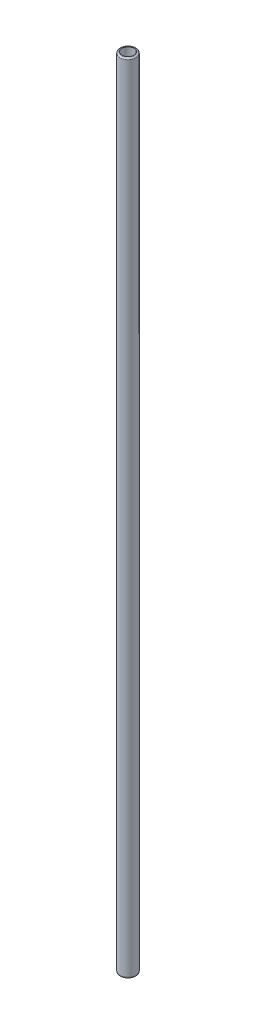
ISO-10303-21;
HEADER;
FILE_DESCRIPTION(('STEP AP214'),'2;1');
FILE_NAME('part.step','',(''),(''),'','','');
FILE_SCHEMA(('AUTOMOTIVE_DESIGN { 1 0 10303 214 1 1 1 1 }'));
ENDSEC;
DATA;
#1=APPLICATION_CONTEXT('core data for automotive mechanical design processes');
#2=APPLICATION_PROTOCOL_DEFINITION('international standard','automotive_design',2000,#1);
#3=PRODUCT_CONTEXT('',#1,'mechanical');
#4=PRODUCT('Part','Part','',(#3));
#5=PRODUCT_RELATED_PRODUCT_CATEGORY('part','',(#4));
#6=PRODUCT_DEFINITION_FORMATION('','',#4);
#7=PRODUCT_DEFINITION_CONTEXT('part definition',#1,'design');
#8=PRODUCT_DEFINITION('design','',#6,#7);
#9=PRODUCT_DEFINITION_SHAPE('','',#8);
#10=(LENGTH_UNIT() NAMED_UNIT(*) SI_UNIT(.MILLI.,.METRE.));
#11=(NAMED_UNIT(*) PLANE_ANGLE_UNIT() SI_UNIT($,.RADIAN.));
#12=(NAMED_UNIT(*) SI_UNIT($,.STERADIAN.) SOLID_ANGLE_UNIT());
#13=UNCERTAINTY_MEASURE_WITH_UNIT(LENGTH_MEASURE(1.E-05),#10,'distance_accuracy_value','');
#14=(GEOMETRIC_REPRESENTATION_CONTEXT(3) GLOBAL_UNCERTAINTY_ASSIGNED_CONTEXT((#13)) GLOBAL_UNIT_ASSIGNED_CONTEXT((#10,
#11,#12)) REPRESENTATION_CONTEXT('',''));
#15=CARTESIAN_POINT('',(0.,0.,0.));
#16=DIRECTION('',(0.,0.,1.));
#17=DIRECTION('',(1.,0.,0.));
#18=AXIS2_PLACEMENT_3D('',#15,#16,#17);
#19=CARTESIAN_POINT('',(0.,600.,0.));
#20=DIRECTION('',(0.,1.,0.));
#21=DIRECTION('',(0.,0.,1.));
#22=AXIS2_PLACEMENT_3D('',#19,#20,#21);
#23=PLANE('',#22);
#24=CARTESIAN_POINT('',(0.,600.,0.));
#25=DIRECTION('',(0.,1.,0.));
#26=DIRECTION('',(0.,0.,1.));
#27=AXIS2_PLACEMENT_3D('',#24,#25,#26);
#28=CIRCLE('',#27,5.);
#29=CARTESIAN_POINT('',(0.,600.,5.));
#30=VERTEX_POINT('',#29);
#31=EDGE_CURVE('E41',#30,#30,#28,.T.);
#32=ORIENTED_EDGE('',*,*,#31,.T.);
#33=EDGE_LOOP('',(#32));
#34=FACE_BOUND('',#33,.T.);
#35=CARTESIAN_POINT('',(0.,600.,0.));
#36=DIRECTION('',(0.,1.,0.));
#37=DIRECTION('',(0.,0.,1.));
#38=AXIS2_PLACEMENT_3D('',#35,#36,#37);
#39=CIRCLE('',#38,4.5);
#40=CARTESIAN_POINT('',(0.,600.,4.5));
#41=VERTEX_POINT('',#40);
#42=EDGE_CURVE('E54',#41,#41,#39,.T.);
#43=ORIENTED_EDGE('',*,*,#42,.F.);
#44=EDGE_LOOP('',(#43));
#45=FACE_BOUND('',#44,.T.);
#46=ADVANCED_FACE('F34',(#34,#45),#23,.T.);
#47=CARTESIAN_POINT('',(0.,0.,0.));
#48=DIRECTION('',(0.,1.,0.));
#49=DIRECTION('',(0.,0.,1.));
#50=AXIS2_PLACEMENT_3D('',#47,#48,#49);
#51=PLANE('',#50);
#52=CARTESIAN_POINT('',(0.,0.,0.));
#53=DIRECTION('',(0.,1.,0.));
#54=DIRECTION('',(0.,0.,1.));
#55=AXIS2_PLACEMENT_3D('',#52,#53,#54);
#56=CIRCLE('',#55,5.);
#57=CARTESIAN_POINT('',(0.,0.,5.));
#58=VERTEX_POINT('',#57);
#59=EDGE_CURVE('E45',#58,#58,#56,.F.);
#60=ORIENTED_EDGE('',*,*,#59,.T.);
#61=EDGE_LOOP('',(#60));
#62=FACE_BOUND('',#61,.T.);
#63=CARTESIAN_POINT('',(0.,0.,0.));
#64=DIRECTION('',(0.,1.,0.));
#65=DIRECTION('',(0.,0.,1.));
#66=AXIS2_PLACEMENT_3D('',#63,#64,#65);
#67=CIRCLE('',#66,4.5);
#68=CARTESIAN_POINT('',(0.,0.,4.5));
#69=VERTEX_POINT('',#68);
#70=EDGE_CURVE('E55',#69,#69,#67,.T.);
#71=ORIENTED_EDGE('',*,*,#70,.T.);
#72=EDGE_LOOP('',(#71));
#73=FACE_BOUND('',#72,.T.);
#74=ADVANCED_FACE('F65',(#62,#73),#51,.F.);
#75=CARTESIAN_POINT('',(0.,600.,0.));
#76=DIRECTION('',(0.,-1.,0.));
#77=DIRECTION('',(0.,0.,-1.));
#78=AXIS2_PLACEMENT_3D('',#75,#76,#77);
#79=CYLINDRICAL_SURFACE('',#78,6.);
#80=CARTESIAN_POINT('',(0.,599.,0.));
#81=DIRECTION('',(0.,1.,0.));
#82=DIRECTION('',(0.,0.,1.));
#83=AXIS2_PLACEMENT_3D('',#80,#81,#82);
#84=CIRCLE('',#83,6.);
#85=CARTESIAN_POINT('',(0.,599.,6.));
#86=VERTEX_POINT('',#85);
#87=EDGE_CURVE('E10',#86,#86,#84,.F.);
#88=ORIENTED_EDGE('',*,*,#87,.T.);
#89=EDGE_LOOP('',(#88));
#90=FACE_BOUND('',#89,.T.);
#91=CARTESIAN_POINT('',(0.,1.,0.));
#92=DIRECTION('',(0.,1.,0.));
#93=DIRECTION('',(0.,0.,1.));
#94=AXIS2_PLACEMENT_3D('',#91,#92,#93);
#95=CIRCLE('',#94,6.);
#96=CARTESIAN_POINT('',(0.,1.,6.));
#97=VERTEX_POINT('',#96);
#98=EDGE_CURVE('E49',#97,#97,#95,.T.);
#99=ORIENTED_EDGE('',*,*,#98,.T.);
#100=EDGE_LOOP('',(#99));
#101=FACE_BOUND('',#100,.T.);
#102=ADVANCED_FACE('F70',(#90,#101),#79,.T.);
#103=CARTESIAN_POINT('',(0.,600.,0.));
#104=DIRECTION('',(0.,-1.,0.));
#105=DIRECTION('',(0.,0.,-1.));
#106=AXIS2_PLACEMENT_3D('',#103,#104,#105);
#107=CYLINDRICAL_SURFACE('',#106,4.5);
#108=ORIENTED_EDGE('',*,*,#42,.T.);
#109=EDGE_LOOP('',(#108));
#110=FACE_BOUND('',#109,.T.);
#111=ORIENTED_EDGE('',*,*,#70,.F.);
#112=EDGE_LOOP('',(#111));
#113=FACE_BOUND('',#112,.T.);
#114=ADVANCED_FACE('F61',(#110,#113),#107,.F.);
#115=CARTESIAN_POINT('',(0.,1.,0.));
#116=DIRECTION('',(0.,1.,0.));
#117=DIRECTION('',(0.,0.,1.));
#118=AXIS2_PLACEMENT_3D('',#115,#116,#117);
#119=TOROIDAL_SURFACE('',#118,5.,1.);
#120=ORIENTED_EDGE('',*,*,#59,.F.);
#121=EDGE_LOOP('',(#120));
#122=FACE_BOUND('',#121,.T.);
#123=ORIENTED_EDGE('',*,*,#98,.F.);
#124=EDGE_LOOP('',(#123));
#125=FACE_BOUND('',#124,.T.);
#126=ADVANCED_FACE('F76',(#122,#125),#119,.T.);
#127=CARTESIAN_POINT('',(0.,599.,0.));
#128=DIRECTION('',(0.,1.,0.));
#129=DIRECTION('',(0.,0.,1.));
#130=AXIS2_PLACEMENT_3D('',#127,#128,#129);
#131=TOROIDAL_SURFACE('',#130,5.,1.);
#132=ORIENTED_EDGE('',*,*,#87,.F.);
#133=EDGE_LOOP('',(#132));
#134=FACE_BOUND('',#133,.T.);
#135=ORIENTED_EDGE('',*,*,#31,.F.);
#136=EDGE_LOOP('',(#135));
#137=FACE_BOUND('',#136,.T.);
#138=ADVANCED_FACE('F36',(#134,#137),#131,.T.);
#139=CLOSED_SHELL('',(#46,#74,#102,#114,#126,#138));
#140=MANIFOLD_SOLID_BREP('B2',#139);
#141=ADVANCED_BREP_SHAPE_REPRESENTATION('',(#18,#140),#14);
#142=SHAPE_DEFINITION_REPRESENTATION(#9,#141);
ENDSEC;
END-ISO-10303-21;
